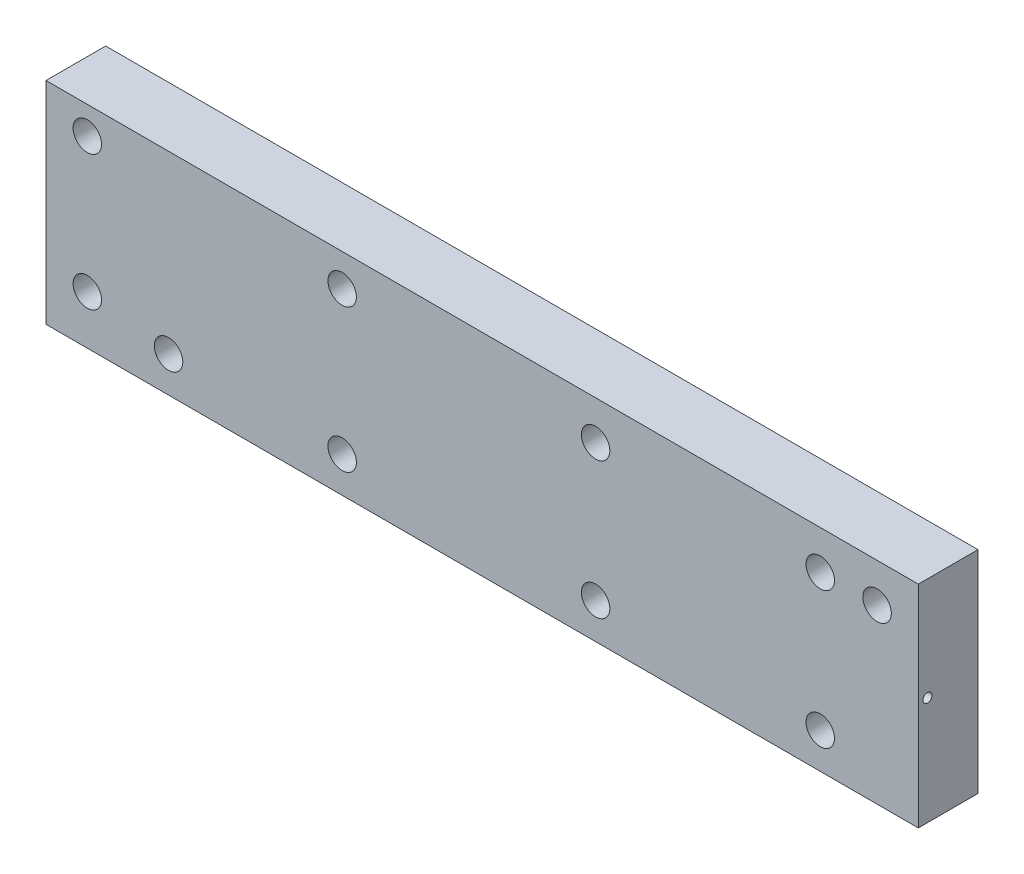
ISO-10303-21;
HEADER;
FILE_DESCRIPTION(('STEP AP214'),'2;1');
FILE_NAME('part.step','',(''),(''),'','','');
FILE_SCHEMA(('AUTOMOTIVE_DESIGN { 1 0 10303 214 1 1 1 1 }'));
ENDSEC;
DATA;
#1=APPLICATION_CONTEXT('core data for automotive mechanical design processes');
#2=APPLICATION_PROTOCOL_DEFINITION('international standard','automotive_design',2000,#1);
#3=PRODUCT_CONTEXT('',#1,'mechanical');
#4=PRODUCT('Part','Part','',(#3));
#5=PRODUCT_RELATED_PRODUCT_CATEGORY('part','',(#4));
#6=PRODUCT_DEFINITION_FORMATION('','',#4);
#7=PRODUCT_DEFINITION_CONTEXT('part definition',#1,'design');
#8=PRODUCT_DEFINITION('design','',#6,#7);
#9=PRODUCT_DEFINITION_SHAPE('','',#8);
#10=(LENGTH_UNIT() NAMED_UNIT(*) SI_UNIT(.MILLI.,.METRE.));
#11=(NAMED_UNIT(*) PLANE_ANGLE_UNIT() SI_UNIT($,.RADIAN.));
#12=(NAMED_UNIT(*) SI_UNIT($,.STERADIAN.) SOLID_ANGLE_UNIT());
#13=UNCERTAINTY_MEASURE_WITH_UNIT(LENGTH_MEASURE(1.E-05),#10,'distance_accuracy_value','');
#14=(GEOMETRIC_REPRESENTATION_CONTEXT(3) GLOBAL_UNCERTAINTY_ASSIGNED_CONTEXT((#13)) GLOBAL_UNIT_ASSIGNED_CONTEXT((#10,
#11,#12)) REPRESENTATION_CONTEXT('',''));
#15=CARTESIAN_POINT('',(0.,0.,0.));
#16=DIRECTION('',(0.,0.,1.));
#17=DIRECTION('',(1.,0.,0.));
#18=AXIS2_PLACEMENT_3D('',#15,#16,#17);
#19=CARTESIAN_POINT('',(12.49,31.,15.));
#20=DIRECTION('',(0.,0.,1.));
#21=DIRECTION('',(0.,-1.,0.));
#22=AXIS2_PLACEMENT_3D('',#19,#20,#21);
#23=PLANE('',#22);
#24=CARTESIAN_POINT('',(72.3541968671441,26.7675678602719,15.));
#25=DIRECTION('',(0.,0.,1.));
#26=DIRECTION('',(0.,-1.,0.));
#27=AXIS2_PLACEMENT_3D('',#24,#25,#26);
#28=CIRCLE('',#27,1.55);
#29=CARTESIAN_POINT('',(72.3541968671441,25.2175678602719,15.));
#30=VERTEX_POINT('',#29);
#31=EDGE_CURVE('E441',#30,#30,#28,.F.);
#32=ORIENTED_EDGE('',*,*,#31,.F.);
#33=EDGE_LOOP('',(#32));
#34=FACE_BOUND('',#33,.T.);
#35=CARTESIAN_POINT('',(103.008357344342,26.7675678602719,15.));
#36=DIRECTION('',(0.,0.,1.));
#37=DIRECTION('',(0.,-1.,0.));
#38=AXIS2_PLACEMENT_3D('',#35,#36,#37);
#39=CIRCLE('',#38,1.55);
#40=CARTESIAN_POINT('',(103.008357344342,25.2175678602719,15.));
#41=VERTEX_POINT('',#40);
#42=EDGE_CURVE('E436',#41,#41,#39,.F.);
#43=ORIENTED_EDGE('',*,*,#42,.F.);
#44=EDGE_LOOP('',(#43));
#45=FACE_BOUND('',#44,.T.);
#46=CARTESIAN_POINT('',(25.8461530651009,11.8834878470165,15.));
#47=DIRECTION('',(0.,0.,1.));
#48=DIRECTION('',(0.,-1.,0.));
#49=AXIS2_PLACEMENT_3D('',#46,#47,#48);
#50=CIRCLE('',#49,1.54999999999999);
#51=CARTESIAN_POINT('',(25.8461530651009,10.3334878470165,15.));
#52=VERTEX_POINT('',#51);
#53=EDGE_CURVE('E430',#52,#52,#50,.F.);
#54=ORIENTED_EDGE('',*,*,#53,.F.);
#55=EDGE_LOOP('',(#54));
#56=FACE_BOUND('',#55,.T.);
#57=CARTESIAN_POINT('',(72.3541968671441,11.8834878470165,15.));
#58=DIRECTION('',(0.,0.,1.));
#59=DIRECTION('',(0.,-1.,0.));
#60=AXIS2_PLACEMENT_3D('',#57,#58,#59);
#61=CIRCLE('',#60,1.55);
#62=CARTESIAN_POINT('',(72.3541968671441,10.3334878470165,15.));
#63=VERTEX_POINT('',#62);
#64=EDGE_CURVE('E424',#63,#63,#61,.F.);
#65=ORIENTED_EDGE('',*,*,#64,.F.);
#66=EDGE_LOOP('',(#65));
#67=FACE_BOUND('',#66,.T.);
#68=CARTESIAN_POINT('',(17.,28.,15.));
#69=DIRECTION('',(0.,0.,1.));
#70=DIRECTION('',(0.,-1.,0.));
#71=AXIS2_PLACEMENT_3D('',#68,#69,#70);
#72=CIRCLE('',#71,1.54999999999999);
#73=CARTESIAN_POINT('',(17.,26.45,15.));
#74=VERTEX_POINT('',#73);
#75=EDGE_CURVE('E419',#74,#74,#72,.F.);
#76=ORIENTED_EDGE('',*,*,#75,.F.);
#77=EDGE_LOOP('',(#76));
#78=FACE_BOUND('',#77,.T.);
#79=DIRECTION('',(0.,1.,0.));
#80=VECTOR('',#79,1.);
#81=CARTESIAN_POINT('',(14.5,19.4953488288822,15.));
#82=LINE('',#81,#80);
#83=CARTESIAN_POINT('',(14.4999999999998,23.5953488288822,15.));
#84=VERTEX_POINT('',#83);
#85=CARTESIAN_POINT('',(14.5,19.4953488288822,15.));
#86=VERTEX_POINT('',#85);
#87=EDGE_CURVE('E411',#84,#86,#82,.F.);
#88=ORIENTED_EDGE('',*,*,#87,.T.);
#89=DIRECTION('',(0.00465114596278413,0.999989183362117,0.));
#90=VECTOR('',#89,1.);
#91=CARTESIAN_POINT('',(14.5,19.4953488288822,15.));
#92=LINE('',#91,#90);
#93=CARTESIAN_POINT('',(14.4809303015523,15.3953931770975,15.));
#94=VERTEX_POINT('',#93);
#95=EDGE_CURVE('E59',#86,#94,#92,.F.);
#96=ORIENTED_EDGE('',*,*,#95,.T.);
#97=DIRECTION('',(0.999989183362117,-0.00465114596278426,0.));
#98=VECTOR('',#97,1.);
#99=CARTESIAN_POINT('',(-1748.49684365872,23.5953488288822,15.));
#100=LINE('',#99,#98);
#101=CARTESIAN_POINT('',(19.9808708100442,15.3698118743025,15.));
#102=VERTEX_POINT('',#101);
#103=EDGE_CURVE('E410',#94,#102,#100,.T.);
#104=ORIENTED_EDGE('',*,*,#103,.T.);
#105=DIRECTION('',(0.00465114596278346,0.999989183362117,0.));
#106=VECTOR('',#105,1.);
#107=CARTESIAN_POINT('',(20.,19.4825581083082,15.));
#108=LINE('',#107,#106);
#109=CARTESIAN_POINT('',(19.9738940911001,13.8698280992594,15.));
#110=VERTEX_POINT('',#109);
#111=EDGE_CURVE('E455',#102,#110,#108,.F.);
#112=ORIENTED_EDGE('',*,*,#111,.T.);
#113=DIRECTION('',(0.999859873952876,0.0167401451289695,0.));
#114=VECTOR('',#113,1.);
#115=CARTESIAN_POINT('',(314.329260657533,18.7980702301612,15.));
#116=LINE('',#115,#114);
#117=CARTESIAN_POINT('',(99.9809897930609,15.2093461940302,15.));
#118=VERTEX_POINT('',#117);
#119=EDGE_CURVE('E389',#110,#118,#116,.T.);
#120=ORIENTED_EDGE('',*,*,#119,.T.);
#121=DIRECTION('',(0.00465114596278346,0.999989183362117,0.));
#122=VECTOR('',#121,1.);
#123=CARTESIAN_POINT('',(100.,19.2965112635962,15.));
#124=LINE('',#123,#122);
#125=CARTESIAN_POINT('',(99.9879665120051,16.7093299690761,15.));
#126=VERTEX_POINT('',#125);
#127=EDGE_CURVE('E384',#118,#126,#124,.T.);
#128=ORIENTED_EDGE('',*,*,#127,.T.);
#129=DIRECTION('',(0.999989183362117,-0.00465114596278426,0.));
#130=VECTOR('',#129,1.);
#131=CARTESIAN_POINT('',(-1012.49799841773,21.8837205430222,15.));
#132=LINE('',#131,#130);
#133=CARTESIAN_POINT('',(105.487907020497,16.6837486662808,15.));
#134=VERTEX_POINT('',#133);
#135=EDGE_CURVE('E377',#126,#134,#132,.T.);
#136=ORIENTED_EDGE('',*,*,#135,.T.);
#137=DIRECTION('',(0.00465114596278591,0.999989183362117,0.));
#138=VECTOR('',#137,1.);
#139=CARTESIAN_POINT('',(105.5,19.2837205430222,15.));
#140=LINE('',#139,#138);
#141=CARTESIAN_POINT('',(105.5,19.2837205430222,15.));
#142=VERTEX_POINT('',#141);
#143=EDGE_CURVE('E11',#134,#142,#140,.T.);
#144=ORIENTED_EDGE('',*,*,#143,.T.);
#145=DIRECTION('',(0.,1.,0.));
#146=VECTOR('',#145,1.);
#147=CARTESIAN_POINT('',(105.5,19.2837205430222,15.));
#148=LINE('',#147,#146);
#149=CARTESIAN_POINT('',(105.5,21.8837205430222,15.));
#150=VERTEX_POINT('',#149);
#151=EDGE_CURVE('E45',#142,#150,#148,.T.);
#152=ORIENTED_EDGE('',*,*,#151,.T.);
#153=DIRECTION('',(-1.,0.,0.));
#154=VECTOR('',#153,1.);
#155=CARTESIAN_POINT('',(-1012.49799841773,21.8837205430222,15.));
#156=LINE('',#155,#154);
#157=CARTESIAN_POINT('',(100.,21.8837205430222,15.));
#158=VERTEX_POINT('',#157);
#159=EDGE_CURVE('E383',#150,#158,#156,.T.);
#160=ORIENTED_EDGE('',*,*,#159,.T.);
#161=DIRECTION('',(0.,1.,0.));
#162=VECTOR('',#161,1.);
#163=CARTESIAN_POINT('',(100.,19.2965112635962,15.));
#164=LINE('',#163,#162);
#165=CARTESIAN_POINT('',(100.,23.383720543025,15.));
#166=VERTEX_POINT('',#165);
#167=EDGE_CURVE('E392',#158,#166,#164,.T.);
#168=ORIENTED_EDGE('',*,*,#167,.T.);
#169=DIRECTION('',(-0.999771197972252,0.0213904582729674,0.));
#170=VECTOR('',#169,1.);
#171=CARTESIAN_POINT('',(314.329260657533,18.7980702301612,15.));
#172=LINE('',#171,#170);
#173=CARTESIAN_POINT('',(20.,25.0953488288818,15.));
#174=VERTEX_POINT('',#173);
#175=EDGE_CURVE('E414',#166,#174,#172,.T.);
#176=ORIENTED_EDGE('',*,*,#175,.T.);
#177=DIRECTION('',(0.,1.,0.));
#178=VECTOR('',#177,1.);
#179=CARTESIAN_POINT('',(20.,19.4825581083082,15.));
#180=LINE('',#179,#178);
#181=CARTESIAN_POINT('',(20.,23.5953488288819,15.));
#182=VERTEX_POINT('',#181);
#183=EDGE_CURVE('E460',#174,#182,#180,.F.);
#184=ORIENTED_EDGE('',*,*,#183,.T.);
#185=DIRECTION('',(-1.,0.,0.));
#186=VECTOR('',#185,1.);
#187=CARTESIAN_POINT('',(-1748.49684365872,23.5953488288822,15.));
#188=LINE('',#187,#186);
#189=EDGE_CURVE('E407',#182,#84,#188,.T.);
#190=ORIENTED_EDGE('',*,*,#189,.T.);
#191=EDGE_LOOP('',(#88,#96,#104,#112,#120,#128,#136,#144,#152,#160,#168,#176,#184,#190));
#192=FACE_BOUND('',#191,.T.);
#193=DIRECTION('',(1.,0.,0.));
#194=VECTOR('',#193,1.);
#195=CARTESIAN_POINT('',(135.,31.,15.));
#196=LINE('',#195,#194);
#197=CARTESIAN_POINT('',(12.5,31.,15.));
#198=VERTEX_POINT('',#197);
#199=CARTESIAN_POINT('',(107.5,31.,15.));
#200=VERTEX_POINT('',#199);
#201=EDGE_CURVE('E446',#198,#200,#196,.T.);
#202=ORIENTED_EDGE('',*,*,#201,.T.);
#203=DIRECTION('',(0.,1.,0.));
#204=VECTOR('',#203,1.);
#205=CARTESIAN_POINT('',(107.5,-104.,15.));
#206=LINE('',#205,#204);
#207=CARTESIAN_POINT('',(107.5,8.,15.));
#208=VERTEX_POINT('',#207);
#209=EDGE_CURVE('E147',#208,#200,#206,.T.);
#210=ORIENTED_EDGE('',*,*,#209,.F.);
#211=DIRECTION('',(1.,0.,0.));
#212=VECTOR('',#211,1.);
#213=CARTESIAN_POINT('',(135.,8.,15.));
#214=LINE('',#213,#212);
#215=CARTESIAN_POINT('',(12.5,8.,15.));
#216=VERTEX_POINT('',#215);
#217=EDGE_CURVE('E444',#216,#208,#214,.T.);
#218=ORIENTED_EDGE('',*,*,#217,.F.);
#219=DIRECTION('',(0.,-1.,0.));
#220=VECTOR('',#219,1.);
#221=CARTESIAN_POINT('',(12.5,-104.,15.));
#222=LINE('',#221,#220);
#223=EDGE_CURVE('E230',#198,#216,#222,.T.);
#224=ORIENTED_EDGE('',*,*,#223,.F.);
#225=EDGE_LOOP('',(#202,#210,#218,#224));
#226=FACE_BOUND('',#225,.T.);
#227=CARTESIAN_POINT('',(96.8197135493571,11.8834878470165,15.));
#228=DIRECTION('',(0.,0.,1.));
#229=DIRECTION('',(0.,-1.,0.));
#230=AXIS2_PLACEMENT_3D('',#227,#228,#229);
#231=CIRCLE('',#230,1.55);
#232=CARTESIAN_POINT('',(96.8197135493571,10.3334878470165,15.));
#233=VERTEX_POINT('',#232);
#234=EDGE_CURVE('E422',#233,#233,#231,.F.);
#235=ORIENTED_EDGE('',*,*,#234,.F.);
#236=EDGE_LOOP('',(#235));
#237=FACE_BOUND('',#236,.T.);
#238=CARTESIAN_POINT('',(44.7527820765865,11.8834878470165,15.));
#239=DIRECTION('',(0.,0.,1.));
#240=DIRECTION('',(0.,-1.,0.));
#241=AXIS2_PLACEMENT_3D('',#238,#239,#240);
#242=CIRCLE('',#241,1.55);
#243=CARTESIAN_POINT('',(44.7527820765865,10.3334878470165,15.));
#244=VERTEX_POINT('',#243);
#245=EDGE_CURVE('E427',#244,#244,#242,.F.);
#246=ORIENTED_EDGE('',*,*,#245,.F.);
#247=EDGE_LOOP('',(#246));
#248=FACE_BOUND('',#247,.T.);
#249=CARTESIAN_POINT('',(17.,13.3193439369581,15.));
#250=DIRECTION('',(0.,0.,1.));
#251=DIRECTION('',(0.,-1.,0.));
#252=AXIS2_PLACEMENT_3D('',#249,#250,#251);
#253=CIRCLE('',#252,1.54999999999999);
#254=CARTESIAN_POINT('',(17.,11.7693439369581,15.));
#255=VERTEX_POINT('',#254);
#256=EDGE_CURVE('E433',#255,#255,#253,.F.);
#257=ORIENTED_EDGE('',*,*,#256,.F.);
#258=EDGE_LOOP('',(#257));
#259=FACE_BOUND('',#258,.T.);
#260=CARTESIAN_POINT('',(96.8197135493571,26.7675678602719,15.));
#261=DIRECTION('',(0.,0.,1.));
#262=DIRECTION('',(0.,-1.,0.));
#263=AXIS2_PLACEMENT_3D('',#260,#261,#262);
#264=CIRCLE('',#263,1.55);
#265=CARTESIAN_POINT('',(96.8197135493571,25.2175678602719,15.));
#266=VERTEX_POINT('',#265);
#267=EDGE_CURVE('E439',#266,#266,#264,.F.);
#268=ORIENTED_EDGE('',*,*,#267,.F.);
#269=EDGE_LOOP('',(#268));
#270=FACE_BOUND('',#269,.T.);
#271=CARTESIAN_POINT('',(44.7527820765865,27.4726032293202,15.));
#272=DIRECTION('',(0.,0.,1.));
#273=DIRECTION('',(0.,-1.,0.));
#274=AXIS2_PLACEMENT_3D('',#271,#272,#273);
#275=CIRCLE('',#274,1.55);
#276=CARTESIAN_POINT('',(44.7527820765865,25.9226032293202,15.));
#277=VERTEX_POINT('',#276);
#278=EDGE_CURVE('E40',#277,#277,#275,.F.);
#279=ORIENTED_EDGE('',*,*,#278,.F.);
#280=EDGE_LOOP('',(#279));
#281=FACE_BOUND('',#280,.T.);
#282=ADVANCED_FACE('F37',(#34,#45,#56,#67,#78,#192,#226,#237,#248,#259,#270,#281),#23,.F.);
#283=CARTESIAN_POINT('',(99.,20.,16.));
#284=DIRECTION('',(0.,0.,1.));
#285=DIRECTION('',(1.,0.,0.));
#286=AXIS2_PLACEMENT_3D('',#283,#284,#285);
#287=CYLINDRICAL_SURFACE('',#286,0.499999999999999);
#288=DIRECTION('',(0.,0.,1.));
#289=VECTOR('',#288,1.);
#290=CARTESIAN_POINT('',(98.95,19.5025062814467,16.));
#291=LINE('',#290,#289);
#292=CARTESIAN_POINT('',(98.95,19.5025062814467,20.919118057874));
#293=VERTEX_POINT('',#292);
#294=CARTESIAN_POINT('',(98.95,19.5025062814467,20.0860205677891));
#295=VERTEX_POINT('',#294);
#296=EDGE_CURVE('E228',#293,#295,#291,.F.);
#297=ORIENTED_EDGE('',*,*,#296,.T.);
#298=CARTESIAN_POINT('',(99.4701014681041,19.8296926023733,21.));
#299=CARTESIAN_POINT('',(99.4774688546878,19.8499127723279,20.9979842904962));
#300=CARTESIAN_POINT('',(99.4834085464336,19.8704958048309,20.9946040285803));
#301=CARTESIAN_POINT('',(99.4925442452967,19.9115218747577,20.9851516344699));
#302=CARTESIAN_POINT('',(99.495756197269,19.9319650230435,20.979095465069));
#303=CARTESIAN_POINT('',(99.4996314927335,19.9721009031409,20.9643045231302));
#304=CARTESIAN_POINT('',(99.5002948625877,19.9917936427125,20.9555697782999));
#305=CARTESIAN_POINT('',(99.4994706969462,20.0298587441883,20.9356586299746));
#306=CARTESIAN_POINT('',(99.4979811139956,20.0482298317554,20.9244799108475));
#307=CARTESIAN_POINT('',(99.4932647506171,20.0838004227334,20.8995903586521));
#308=CARTESIAN_POINT('',(99.4899837937804,20.1009434640651,20.8858098217039));
#309=CARTESIAN_POINT('',(99.4822336342976,20.1331361659019,20.8562846501941));
#310=CARTESIAN_POINT('',(99.4777637694054,20.148184652559,20.8405389235843));
#311=CARTESIAN_POINT('',(99.4672837241488,20.1787609896256,20.8040947204159));
#312=CARTESIAN_POINT('',(99.4611432182762,20.1938082661447,20.7830295939592));
#313=CARTESIAN_POINT('',(99.4489884944372,20.2205107731916,20.7387862072529));
#314=CARTESIAN_POINT('',(99.4429744382683,20.2321618773428,20.7156054209708));
#315=CARTESIAN_POINT('',(99.4314867831335,20.2529353790743,20.6647084715541));
#316=CARTESIAN_POINT('',(99.4261530042551,20.2616179526596,20.6367765523052));
#317=CARTESIAN_POINT('',(99.4183182044755,20.2739829819091,20.5794726795957));
#318=CARTESIAN_POINT('',(99.4158101298066,20.2776778928029,20.5501045037275));
#319=CARTESIAN_POINT('',(99.4144741278076,20.2796626470272,20.4951847310749));
#320=CARTESIAN_POINT('',(99.4151850689781,20.2786295427458,20.4696672234916));
#321=CARTESIAN_POINT('',(99.4190797874766,20.2727343555928,20.419265578987));
#322=CARTESIAN_POINT('',(99.4222654437116,20.2678693633527,20.3943819381562));
#323=CARTESIAN_POINT('',(99.4301885645206,20.2549331699153,20.3472693659653));
#324=CARTESIAN_POINT('',(99.4348301847968,20.2470547145151,20.3249697408449));
#325=CARTESIAN_POINT('',(99.4449475443564,20.2283305472458,20.2818488804111));
#326=CARTESIAN_POINT('',(99.4504239036889,20.2174826248315,20.2610287610805));
#327=CARTESIAN_POINT('',(99.4624244368935,20.1908230760405,20.2175802674018));
#328=CARTESIAN_POINT('',(99.4689624890417,20.1744727084044,20.1952842055542));
#329=CARTESIAN_POINT('',(99.4809181656528,20.1381400597493,20.1535245114158));
#330=CARTESIAN_POINT('',(99.4863366101286,20.1181604571199,20.1340588092574));
#331=CARTESIAN_POINT('',(99.4940278146444,20.0790790660161,20.1019380807881));
#332=CARTESIAN_POINT('',(99.4967045460814,20.0605436449207,20.0886928309633));
#333=CARTESIAN_POINT('',(99.49990775248,20.0216994598741,20.0647917445634));
#334=CARTESIAN_POINT('',(99.5004362504364,20.001392382715,20.0541334807194));
#335=CARTESIAN_POINT('',(99.4987966969851,19.9594473548212,20.0356735523955));
#336=CARTESIAN_POINT('',(99.4966113200138,19.937801700056,20.027890657647));
#337=CARTESIAN_POINT('',(99.4891659120319,19.8941410152587,20.0154624482384));
#338=CARTESIAN_POINT('',(99.4839070133731,19.872126124161,20.010815979409));
#339=CARTESIAN_POINT('',(99.470986951121,19.830917816833,20.0048746038622));
#340=CARTESIAN_POINT('',(99.4636326262835,19.8116691421163,20.0032813070208));
#341=CARTESIAN_POINT('',(99.4465781960761,19.7741856430768,20.002241481801));
#342=CARTESIAN_POINT('',(99.4368775611793,19.755951048761,20.0027954384501));
#343=CARTESIAN_POINT('',(99.4148955209144,19.7201372189167,20.0057146824016));
#344=CARTESIAN_POINT('',(99.402517663202,19.7026243477743,20.0081603180715));
#345=CARTESIAN_POINT('',(99.3757751596434,19.6694741611717,20.0144361803188));
#346=CARTESIAN_POINT('',(99.3614097139939,19.6538376054926,20.018266965285));
#347=CARTESIAN_POINT('',(99.3282394656705,19.6220089808324,20.0275393655168));
#348=CARTESIAN_POINT('',(99.3090997224873,19.6062142755736,20.033146374118));
#349=CARTESIAN_POINT('',(99.2687439855616,19.5776382793501,20.0446790088129));
#350=CARTESIAN_POINT('',(99.2475248511638,19.564861649232,20.0506051105801));
#351=CARTESIAN_POINT('',(99.1997933230874,19.5407548740718,20.0627781922216));
#352=CARTESIAN_POINT('',(99.1729746016716,19.5299733635102,20.0689276106349));
#353=CARTESIAN_POINT('',(99.1175330796776,19.5131539614114,20.0790277069308));
#354=CARTESIAN_POINT('',(99.0889160072931,19.5071017585535,20.0829850076991));
#355=CARTESIAN_POINT('',(99.0417249554963,19.501408157889,20.0867432752652));
#356=CARTESIAN_POINT('',(99.0234073889952,19.5002140785748,20.0875461945066));
#357=CARTESIAN_POINT('',(98.9866811187587,19.4998368022868,20.0878105878154));
#358=CARTESIAN_POINT('',(98.9682723157987,19.500660387847,20.0872675372311));
#359=CARTESIAN_POINT('',(98.95,19.5025062814467,20.0860205677891));
#360=B_SPLINE_CURVE_WITH_KNOTS('',3,(#298,#299,#300,#301,#302,#303,#304,#305,#306,#307,#308,
#309,#310,#311,#312,#313,#314,#315,#316,#317,#318,#319,#320,#321,#322,#323,#324,#325,#326,#327,
#328,#329,#330,#331,#332,#333,#334,#335,#336,#337,#338,#339,#340,#341,#342,#343,#344,#345,#346,
#347,#348,#349,#350,#351,#352,#353,#354,#355,#356,#357,#358,#359),.UNSPECIFIED.,.F.,.F.,(4,2,2,
2,2,2,2,2,2,2,2,2,2,2,2,2,2,2,2,2,2,2,2,2,2,2,2,2,2,2,4),(0.,0.0647290245250579,0.1290770223543,
0.193424354580422,0.257832921303913,0.324306933423682,0.390818050749882,0.470321411939918,
0.549920971505537,0.638596933170055,0.727051040321775,0.803267833475031,0.879542550226478,
0.951587770671656,1.02368676991559,1.10854858975764,1.1933480338333,1.26188622253321,
1.33035985374064,1.39927288135139,1.46816053590199,1.52988145180107,1.591616310206,
1.65612784413127,1.72066541334236,1.79670117965547,1.87285361218891,1.9610538694392,
2.04898617970982,2.10395699193108,2.15911284612362),.UNSPECIFIED.);
#361=CARTESIAN_POINT('',(99.4701014681041,19.8296926023733,21.));
#362=VERTEX_POINT('',#361);
#363=EDGE_CURVE('E222',#362,#295,#360,.T.);
#364=ORIENTED_EDGE('',*,*,#363,.F.);
#365=CARTESIAN_POINT('',(99.,20.,21.));
#366=DIRECTION('',(0.,0.,1.));
#367=DIRECTION('',(1.,0.,0.));
#368=AXIS2_PLACEMENT_3D('',#365,#366,#367);
#369=CIRCLE('',#368,0.499999999999999);
#370=CARTESIAN_POINT('',(99.4198315160856,19.7284461414356,21.));
#371=VERTEX_POINT('',#370);
#372=EDGE_CURVE('E203',#362,#371,#369,.T.);
#373=ORIENTED_EDGE('',*,*,#372,.T.);
#374=CARTESIAN_POINT('',(98.95,19.5025062814467,20.919118057874));
#375=CARTESIAN_POINT('',(98.9624965972271,19.5012492106486,20.9182795934042));
#376=CARTESIAN_POINT('',(98.9750563476169,19.5004640640067,20.9177543183625));
#377=CARTESIAN_POINT('',(99.0002026466028,19.4998420414642,20.9173377679787));
#378=CARTESIAN_POINT('',(99.0127891761434,19.5000046322368,20.9174461360623));
#379=CARTESIAN_POINT('',(99.0502240641956,19.5019072607446,20.9187241382645));
#380=CARTESIAN_POINT('',(99.0749869604941,19.5050384579037,20.9208306896537));
#381=CARTESIAN_POINT('',(99.1234443958593,19.5148467577854,20.9270909126284));
#382=CARTESIAN_POINT('',(99.1471408686169,19.5215171367892,20.9312407014093));
#383=CARTESIAN_POINT('',(99.1931392384423,19.5381587409854,20.9408089746067));
#384=CARTESIAN_POINT('',(99.215436744906,19.5481397951203,20.9462312225886));
#385=CARTESIAN_POINT('',(99.2603261184848,19.5722834390689,20.9580217679895));
#386=CARTESIAN_POINT('',(99.2827403038141,19.5867557243691,20.9644309040114));
#387=CARTESIAN_POINT('',(99.325052222324,19.6191484020611,20.9766194595065));
#388=CARTESIAN_POINT('',(99.34495604051,19.6370601803873,20.9824003967983));
#389=CARTESIAN_POINT('',(99.3737920024126,19.667571024913,20.9901112422122));
#390=CARTESIAN_POINT('',(99.3837273004194,19.6790865492227,20.9926218508166));
#391=CARTESIAN_POINT('',(99.4025746948953,19.7030710978297,20.9969103213568));
#392=CARTESIAN_POINT('',(99.4114857036664,19.7155411127269,20.9986874094563));
#393=CARTESIAN_POINT('',(99.4198315160856,19.7284461414356,21.));
#394=B_SPLINE_CURVE_WITH_KNOTS('',3,(#374,#375,#376,#377,#378,#379,#380,#381,#382,#383,#384,
#385,#386,#387,#388,#389,#390,#391,#392,#393),.UNSPECIFIED.,.F.,.F.,(4,2,2,2,2,2,2,2,2,4),(0.,
0.037739301385199,0.075457367527859,0.150181501446608,0.224764180497007,0.299570297377233,
0.381566175862673,0.463359316092883,0.50953094221899,0.555751153924889),.UNSPECIFIED.);
#395=EDGE_CURVE('E227',#293,#371,#394,.T.);
#396=ORIENTED_EDGE('',*,*,#395,.F.);
#397=EDGE_LOOP('',(#297,#364,#373,#396));
#398=FACE_BOUND('',#397,.T.);
#399=CARTESIAN_POINT('',(98.6442776283622,19.6486288830235,19.0980535592392));
#400=CARTESIAN_POINT('',(98.6639118073722,19.6287532179292,19.099365509122));
#401=CARTESIAN_POINT('',(98.685238733778,19.6105041582648,19.1003615489505));
#402=CARTESIAN_POINT('',(98.7306702362938,19.5778076803801,19.1018334368221));
#403=CARTESIAN_POINT('',(98.7547777396331,19.5633643220794,19.1023087310269));
#404=CARTESIAN_POINT('',(98.8050603197376,19.5387172703958,19.1028520209217));
#405=CARTESIAN_POINT('',(98.8312342615941,19.5285112688281,19.1029202386271));
#406=CARTESIAN_POINT('',(98.8849126832868,19.5126209388884,19.1027453384334));
#407=CARTESIAN_POINT('',(98.9124168893627,19.5069356843381,19.1025022843322));
#408=CARTESIAN_POINT('',(98.9680452901828,19.5002346661814,19.1017677457357));
#409=CARTESIAN_POINT('',(98.9961706901737,19.4992289627337,19.1012757285298));
#410=CARTESIAN_POINT('',(99.0521888253917,19.5019410430946,19.1000664566654));
#411=CARTESIAN_POINT('',(99.0800815513319,19.5056590145441,19.0993491930601));
#412=CARTESIAN_POINT('',(99.1348861022054,19.5177198154422,19.0976694539896));
#413=CARTESIAN_POINT('',(99.1617963513786,19.5260697541267,19.0967066028218));
#414=CARTESIAN_POINT('',(99.2138256100011,19.5471572736037,19.0944800116797));
#415=CARTESIAN_POINT('',(99.2389446205736,19.5598948516453,19.093216271894));
#416=CARTESIAN_POINT('',(99.2866853170021,19.5893918189684,19.09030480816));
#417=CARTESIAN_POINT('',(99.3093061782029,19.6061525305525,19.0886569579695));
#418=CARTESIAN_POINT('',(99.3513990857811,19.6432020444003,19.084884398081));
#419=CARTESIAN_POINT('',(99.3708711813345,19.6634907915546,19.0827596958314));
#420=CARTESIAN_POINT('',(99.4061212813782,19.7069993094862,19.0779485681146));
#421=CARTESIAN_POINT('',(99.4218992150937,19.7302191364055,19.0752621318871));
#422=CARTESIAN_POINT('',(99.4493304848308,19.7789053091294,19.0692700700642));
#423=CARTESIAN_POINT('',(99.4609838169861,19.8043716570397,19.0659644438884));
#424=CARTESIAN_POINT('',(99.4798982066447,19.8568938953284,19.0587079373691));
#425=CARTESIAN_POINT('',(99.4871448217275,19.883954696892,19.0547549886618));
#426=CARTESIAN_POINT('',(99.4970243233767,19.938813551295,19.0462517889327));
#427=CARTESIAN_POINT('',(99.4996569432006,19.9666116466642,19.0417015033943));
#428=CARTESIAN_POINT('',(99.5002837741891,20.0224949678258,19.0320469072202));
#429=CARTESIAN_POINT('',(99.4982238427238,20.0505797851252,19.026936783817));
#430=CARTESIAN_POINT('',(99.4894500775863,20.1059456990636,19.0163677454663));
#431=CARTESIAN_POINT('',(99.4827357137809,20.1332267037803,19.0109087908518));
#432=CARTESIAN_POINT('',(99.464703002911,20.1867109502839,18.9997616285321));
#433=CARTESIAN_POINT('',(99.4533084021397,20.2128880195923,18.9940711018974));
#434=CARTESIAN_POINT('',(99.4262241375252,20.2629507258796,18.9828189886846));
#435=CARTESIAN_POINT('',(99.4105340972689,20.2868361617929,18.9772574134528));
#436=CARTESIAN_POINT('',(99.3751538085751,20.3317869411573,18.9665315772364));
#437=CARTESIAN_POINT('',(99.3554397970389,20.3528342376555,18.9613699401793));
#438=CARTESIAN_POINT('',(99.3125853936342,20.3913044219291,18.9518031550846));
#439=CARTESIAN_POINT('',(99.2894453672948,20.4087276958831,18.9473979264523));
#440=CARTESIAN_POINT('',(99.240885265801,20.439063424427,18.9397343162875));
#441=CARTESIAN_POINT('',(99.2155226955323,20.4520622460933,18.9364539658427));
#442=CARTESIAN_POINT('',(99.1628446214462,20.4735932912172,18.931165793708));
#443=CARTESIAN_POINT('',(99.1355296600271,20.4821267497681,18.9291576201091));
#444=CARTESIAN_POINT('',(99.080840932457,20.4941851496691,18.9266341237527));
#445=CARTESIAN_POINT('',(99.0535088004551,20.4978880040298,18.9260649996176));
#446=CARTESIAN_POINT('',(98.9986162897586,20.5007525594579,18.9263228837002));
#447=CARTESIAN_POINT('',(98.971055944331,20.4999149111548,18.9271496918768));
#448=CARTESIAN_POINT('',(98.9170837860674,20.4938091885474,18.9301251492837));
#449=CARTESIAN_POINT('',(98.8906600097688,20.4886324910256,18.9322462922626));
#450=CARTESIAN_POINT('',(98.8390939907852,20.4741588154427,18.937656787168));
#451=CARTESIAN_POINT('',(98.8139518406242,20.4648615403744,18.9409462233007));
#452=CARTESIAN_POINT('',(98.7651655498171,20.4422536958424,18.9485631241689));
#453=CARTESIAN_POINT('',(98.7415555738685,20.4288753542283,18.952907843799));
#454=CARTESIAN_POINT('',(98.6969024170357,20.3985728750711,18.9623514505185));
#455=CARTESIAN_POINT('',(98.6758597508033,20.3816480284253,18.9674504883694));
#456=CARTESIAN_POINT('',(98.636046646496,20.3439746927847,18.9783446009619));
#457=CARTESIAN_POINT('',(98.6174004588662,20.3231005296703,18.9841593363216));
#458=CARTESIAN_POINT('',(98.5838625724069,20.2785798297343,18.9960058742143));
#459=CARTESIAN_POINT('',(98.5689715444342,20.2549327986456,19.0020377153134));
#460=CARTESIAN_POINT('',(98.54295435188,20.204768197417,19.014202545222));
#461=CARTESIAN_POINT('',(98.5319478729173,20.1781879280341,19.0203335020105));
#462=CARTESIAN_POINT('',(98.514633622152,20.1234627879741,19.0322419059751));
#463=CARTESIAN_POINT('',(98.5083257296798,20.0953179574982,19.0380193622262));
#464=CARTESIAN_POINT('',(98.5006428886348,20.0383113989186,19.0489796465435));
#465=CARTESIAN_POINT('',(98.4992572273157,20.0094513655087,19.0541637421545));
#466=CARTESIAN_POINT('',(98.5014940438912,19.9517932740901,19.0637852284013));
#467=CARTESIAN_POINT('',(98.505116956392,19.9229952216768,19.0682225542006));
#468=CARTESIAN_POINT('',(98.5171909557283,19.866960611517,19.0761666260789));
#469=CARTESIAN_POINT('',(98.52553640299,19.8397037832456,19.0796913520835));
#470=CARTESIAN_POINT('',(98.5467735494023,19.78694493572,19.0859087071225));
#471=CARTESIAN_POINT('',(98.5596598991785,19.7614408936755,19.0886023082841));
#472=CARTESIAN_POINT('',(98.5845106227582,19.7212114142872,19.0924194654993));
#473=CARTESIAN_POINT('',(98.5953002308935,19.7057683264934,19.0937655040497));
#474=CARTESIAN_POINT('',(98.6185624392304,19.6761798159928,19.0961401146563));
#475=CARTESIAN_POINT('',(98.6310350129923,19.6620343729057,19.097168691699));
#476=CARTESIAN_POINT('',(98.6442776283622,19.6486288830235,19.0980535592392));
#477=B_SPLINE_CURVE_WITH_KNOTS('',3,(#399,#400,#401,#402,#403,#404,#405,#406,#407,#408,#409,
#410,#411,#412,#413,#414,#415,#416,#417,#418,#419,#420,#421,#422,#423,#424,#425,#426,#427,#428,
#429,#430,#431,#432,#433,#434,#435,#436,#437,#438,#439,#440,#441,#442,#443,#444,#445,#446,#447,
#448,#449,#450,#451,#452,#453,#454,#455,#456,#457,#458,#459,#460,#461,#462,#463,#464,#465,#466,
#467,#468,#469,#470,#471,#472,#473,#474,#475,#476),.UNSPECIFIED.,.T.,.F.,(4,2,2,2,2,2,2,2,2,2,2,
2,2,2,2,2,2,2,2,2,2,2,2,2,2,2,2,2,2,2,2,2,2,2,2,2,2,2,4),(0.,0.0838381024969042,
0.167765284593441,0.251646689467256,0.335510904889217,0.41955532962654,0.503603093004901,
0.587780212912477,0.671957280044492,0.756162052030789,0.840365508818736,0.924570578690834,
1.00877572749292,1.09325538052217,1.17773991729511,1.26320416627444,1.34867815111035,
1.4356037568699,1.5225369824367,1.60999926036542,1.69745221346334,1.78308429614242,
1.86869268095502,1.9510496814232,2.03339488089235,2.11404829618687,2.19470752584703,
2.27678675386831,2.3588824088315,2.44425551695864,2.52964386614832,2.61747118228329,
2.70529624274852,2.7929300432009,2.88057144832918,2.96632576498255,3.05197939531753,
3.10852635785895,3.16507243213804),.UNSPECIFIED.);
#478=CARTESIAN_POINT('',(98.6442776283622,19.6486288830235,19.0980535592392));
#479=VERTEX_POINT('',#478);
#480=EDGE_CURVE('E271',#479,#479,#477,.T.);
#481=ORIENTED_EDGE('',*,*,#480,.F.);
#482=EDGE_LOOP('',(#481));
#483=FACE_BOUND('',#482,.T.);
#484=ADVANCED_FACE('F261',(#398,#483),#287,.F.);
#485=CARTESIAN_POINT('',(135.,31.,0.));
#486=DIRECTION('',(0.,1.,0.));
#487=DIRECTION('',(0.,0.,1.));
#488=AXIS2_PLACEMENT_3D('',#485,#486,#487);
#489=PLANE('',#488);
#490=ORIENTED_EDGE('',*,*,#201,.F.);
#491=DIRECTION('',(0.,0.,-1.));
#492=VECTOR('',#491,1.);
#493=CARTESIAN_POINT('',(12.5,31.,21.5));
#494=LINE('',#493,#492);
#495=CARTESIAN_POINT('',(12.5,31.,21.5));
#496=VERTEX_POINT('',#495);
#497=EDGE_CURVE('E166',#496,#198,#494,.T.);
#498=ORIENTED_EDGE('',*,*,#497,.F.);
#499=DIRECTION('',(-1.,0.,0.));
#500=VECTOR('',#499,1.);
#501=CARTESIAN_POINT('',(135.,31.,21.5));
#502=LINE('',#501,#500);
#503=CARTESIAN_POINT('',(107.5,31.,21.5));
#504=VERTEX_POINT('',#503);
#505=EDGE_CURVE('E158',#504,#496,#502,.T.);
#506=ORIENTED_EDGE('',*,*,#505,.F.);
#507=DIRECTION('',(0.,0.,1.));
#508=VECTOR('',#507,1.);
#509=CARTESIAN_POINT('',(107.5,31.,21.5));
#510=LINE('',#509,#508);
#511=EDGE_CURVE('E140',#200,#504,#510,.T.);
#512=ORIENTED_EDGE('',*,*,#511,.F.);
#513=EDGE_LOOP('',(#490,#498,#506,#512));
#514=FACE_BOUND('',#513,.T.);
#515=ADVANCED_FACE('F164',(#514),#489,.T.);
#516=CARTESIAN_POINT('',(135.,7.99999999999999,0.));
#517=DIRECTION('',(0.,1.,0.));
#518=DIRECTION('',(0.,0.,1.));
#519=AXIS2_PLACEMENT_3D('',#516,#517,#518);
#520=PLANE('',#519);
#521=DIRECTION('',(0.,0.,-1.));
#522=VECTOR('',#521,1.);
#523=CARTESIAN_POINT('',(12.5,7.99999999999999,0.));
#524=LINE('',#523,#522);
#525=CARTESIAN_POINT('',(12.5,7.99999999999999,21.5));
#526=VERTEX_POINT('',#525);
#527=EDGE_CURVE('E172',#526,#216,#524,.T.);
#528=ORIENTED_EDGE('',*,*,#527,.T.);
#529=ORIENTED_EDGE('',*,*,#217,.T.);
#530=DIRECTION('',(0.,0.,1.));
#531=VECTOR('',#530,1.);
#532=CARTESIAN_POINT('',(107.5,7.99999999999999,0.));
#533=LINE('',#532,#531);
#534=CARTESIAN_POINT('',(107.5,7.99999999999999,21.5));
#535=VERTEX_POINT('',#534);
#536=EDGE_CURVE('E471',#208,#535,#533,.T.);
#537=ORIENTED_EDGE('',*,*,#536,.T.);
#538=DIRECTION('',(-1.,0.,0.));
#539=VECTOR('',#538,1.);
#540=CARTESIAN_POINT('',(135.,8.,21.5));
#541=LINE('',#540,#539);
#542=EDGE_CURVE('E160',#535,#526,#541,.T.);
#543=ORIENTED_EDGE('',*,*,#542,.T.);
#544=EDGE_LOOP('',(#528,#529,#537,#543));
#545=FACE_BOUND('',#544,.T.);
#546=ADVANCED_FACE('F308',(#545),#520,.F.);
#547=CARTESIAN_POINT('',(135.,0.,21.5));
#548=DIRECTION('',(0.,0.,-1.));
#549=DIRECTION('',(-1.,0.,0.));
#550=AXIS2_PLACEMENT_3D('',#547,#548,#549);
#551=PLANE('',#550);
#552=CARTESIAN_POINT('',(72.3541968671441,11.8834878470165,21.5));
#553=DIRECTION('',(0.,0.,-1.));
#554=DIRECTION('',(-1.,0.,0.));
#555=AXIS2_PLACEMENT_3D('',#552,#553,#554);
#556=CIRCLE('',#555,1.55);
#557=CARTESIAN_POINT('',(70.8041968671441,11.8834878470165,21.5));
#558=VERTEX_POINT('',#557);
#559=EDGE_CURVE('E197',#558,#558,#556,.F.);
#560=ORIENTED_EDGE('',*,*,#559,.F.);
#561=EDGE_LOOP('',(#560));
#562=FACE_BOUND('',#561,.T.);
#563=CARTESIAN_POINT('',(25.8461530651009,11.8834878470165,21.5));
#564=DIRECTION('',(0.,0.,-1.));
#565=DIRECTION('',(-1.,0.,0.));
#566=AXIS2_PLACEMENT_3D('',#563,#564,#565);
#567=CIRCLE('',#566,1.54999999999999);
#568=CARTESIAN_POINT('',(24.2961530651009,11.8834878470165,21.5));
#569=VERTEX_POINT('',#568);
#570=EDGE_CURVE('E191',#569,#569,#567,.F.);
#571=ORIENTED_EDGE('',*,*,#570,.F.);
#572=EDGE_LOOP('',(#571));
#573=FACE_BOUND('',#572,.T.);
#574=CARTESIAN_POINT('',(103.008357344342,26.7675678602719,21.5));
#575=DIRECTION('',(0.,0.,-1.));
#576=DIRECTION('',(-1.,0.,0.));
#577=AXIS2_PLACEMENT_3D('',#574,#575,#576);
#578=CIRCLE('',#577,1.55);
#579=CARTESIAN_POINT('',(101.458357344342,26.7675678602719,21.5));
#580=VERTEX_POINT('',#579);
#581=EDGE_CURVE('E185',#580,#580,#578,.F.);
#582=ORIENTED_EDGE('',*,*,#581,.F.);
#583=EDGE_LOOP('',(#582));
#584=FACE_BOUND('',#583,.T.);
#585=CARTESIAN_POINT('',(72.3541968671441,26.7675678602719,21.5));
#586=DIRECTION('',(0.,0.,-1.));
#587=DIRECTION('',(-1.,0.,0.));
#588=AXIS2_PLACEMENT_3D('',#585,#586,#587);
#589=CIRCLE('',#588,1.55);
#590=CARTESIAN_POINT('',(70.8041968671441,26.7675678602719,21.5));
#591=VERTEX_POINT('',#590);
#592=EDGE_CURVE('E179',#591,#591,#589,.F.);
#593=ORIENTED_EDGE('',*,*,#592,.F.);
#594=EDGE_LOOP('',(#593));
#595=FACE_BOUND('',#594,.T.);
#596=CARTESIAN_POINT('',(17.,28.,21.5));
#597=DIRECTION('',(0.,0.,-1.));
#598=DIRECTION('',(-1.,0.,0.));
#599=AXIS2_PLACEMENT_3D('',#596,#597,#598);
#600=CIRCLE('',#599,1.54999999999999);
#601=CARTESIAN_POINT('',(15.45,28.,21.5));
#602=VERTEX_POINT('',#601);
#603=EDGE_CURVE('E167',#602,#602,#600,.F.);
#604=ORIENTED_EDGE('',*,*,#603,.F.);
#605=EDGE_LOOP('',(#604));
#606=FACE_BOUND('',#605,.T.);
#607=CARTESIAN_POINT('',(44.7527820765865,27.4726032293202,21.5));
#608=DIRECTION('',(0.,0.,-1.));
#609=DIRECTION('',(-1.,0.,0.));
#610=AXIS2_PLACEMENT_3D('',#607,#608,#609);
#611=CIRCLE('',#610,1.55);
#612=CARTESIAN_POINT('',(43.2027820765865,27.4726032293202,21.5));
#613=VERTEX_POINT('',#612);
#614=EDGE_CURVE('E170',#613,#613,#611,.F.);
#615=ORIENTED_EDGE('',*,*,#614,.F.);
#616=EDGE_LOOP('',(#615));
#617=FACE_BOUND('',#616,.T.);
#618=CARTESIAN_POINT('',(96.8197135493571,26.7675678602719,21.5));
#619=DIRECTION('',(0.,0.,-1.));
#620=DIRECTION('',(-1.,0.,0.));
#621=AXIS2_PLACEMENT_3D('',#618,#619,#620);
#622=CIRCLE('',#621,1.55);
#623=CARTESIAN_POINT('',(95.2697135493571,26.7675678602719,21.5));
#624=VERTEX_POINT('',#623);
#625=EDGE_CURVE('E182',#624,#624,#622,.F.);
#626=ORIENTED_EDGE('',*,*,#625,.F.);
#627=EDGE_LOOP('',(#626));
#628=FACE_BOUND('',#627,.T.);
#629=CARTESIAN_POINT('',(17.,13.3193439369581,21.5));
#630=DIRECTION('',(0.,0.,-1.));
#631=DIRECTION('',(-1.,0.,0.));
#632=AXIS2_PLACEMENT_3D('',#629,#630,#631);
#633=CIRCLE('',#632,1.54999999999999);
#634=CARTESIAN_POINT('',(15.45,13.3193439369581,21.5));
#635=VERTEX_POINT('',#634);
#636=EDGE_CURVE('E188',#635,#635,#633,.F.);
#637=ORIENTED_EDGE('',*,*,#636,.F.);
#638=EDGE_LOOP('',(#637));
#639=FACE_BOUND('',#638,.T.);
#640=CARTESIAN_POINT('',(44.7527820765865,11.8834878470165,21.5));
#641=DIRECTION('',(0.,0.,-1.));
#642=DIRECTION('',(-1.,0.,0.));
#643=AXIS2_PLACEMENT_3D('',#640,#641,#642);
#644=CIRCLE('',#643,1.55);
#645=CARTESIAN_POINT('',(43.2027820765865,11.8834878470165,21.5));
#646=VERTEX_POINT('',#645);
#647=EDGE_CURVE('E194',#646,#646,#644,.F.);
#648=ORIENTED_EDGE('',*,*,#647,.F.);
#649=EDGE_LOOP('',(#648));
#650=FACE_BOUND('',#649,.T.);
#651=CARTESIAN_POINT('',(96.8197135493571,11.8834878470165,21.5));
#652=DIRECTION('',(0.,0.,-1.));
#653=DIRECTION('',(-1.,0.,0.));
#654=AXIS2_PLACEMENT_3D('',#651,#652,#653);
#655=CIRCLE('',#654,1.55);
#656=CARTESIAN_POINT('',(95.2697135493571,11.8834878470165,21.5));
#657=VERTEX_POINT('',#656);
#658=EDGE_CURVE('E200',#657,#657,#655,.F.);
#659=ORIENTED_EDGE('',*,*,#658,.F.);
#660=EDGE_LOOP('',(#659));
#661=FACE_BOUND('',#660,.T.);
#662=ORIENTED_EDGE('',*,*,#542,.F.);
#663=DIRECTION('',(0.,1.,0.));
#664=VECTOR('',#663,1.);
#665=CARTESIAN_POINT('',(107.5,-104.,21.5));
#666=LINE('',#665,#664);
#667=EDGE_CURVE('E144',#535,#504,#666,.T.);
#668=ORIENTED_EDGE('',*,*,#667,.T.);
#669=ORIENTED_EDGE('',*,*,#505,.T.);
#670=DIRECTION('',(0.,1.,0.));
#671=VECTOR('',#670,1.);
#672=CARTESIAN_POINT('',(12.5,-104.,21.5));
#673=LINE('',#672,#671);
#674=EDGE_CURVE('E152',#526,#496,#673,.T.);
#675=ORIENTED_EDGE('',*,*,#674,.F.);
#676=EDGE_LOOP('',(#662,#668,#669,#675));
#677=FACE_BOUND('',#676,.T.);
#678=ADVANCED_FACE('F156',(#562,#573,#584,#595,#606,#617,#628,#639,#650,#661,#677),#551,.F.);
#679=CARTESIAN_POINT('',(44.7527820765865,27.4726032293202,0.));
#680=DIRECTION('',(0.,0.,-1.));
#681=DIRECTION('',(-1.,0.,0.));
#682=AXIS2_PLACEMENT_3D('',#679,#680,#681);
#683=CYLINDRICAL_SURFACE('',#682,1.55);
#684=ORIENTED_EDGE('',*,*,#278,.T.);
#685=EDGE_LOOP('',(#684));
#686=FACE_BOUND('',#685,.T.);
#687=ORIENTED_EDGE('',*,*,#614,.T.);
#688=EDGE_LOOP('',(#687));
#689=FACE_BOUND('',#688,.T.);
#690=ADVANCED_FACE('F314',(#686,#689),#683,.F.);
#691=CARTESIAN_POINT('',(72.3541968671441,26.7675678602719,0.));
#692=DIRECTION('',(0.,0.,-1.));
#693=DIRECTION('',(-1.,0.,0.));
#694=AXIS2_PLACEMENT_3D('',#691,#692,#693);
#695=CYLINDRICAL_SURFACE('',#694,1.55);
#696=ORIENTED_EDGE('',*,*,#31,.T.);
#697=EDGE_LOOP('',(#696));
#698=FACE_BOUND('',#697,.T.);
#699=ORIENTED_EDGE('',*,*,#592,.T.);
#700=EDGE_LOOP('',(#699));
#701=FACE_BOUND('',#700,.T.);
#702=ADVANCED_FACE('F322',(#698,#701),#695,.F.);
#703=CARTESIAN_POINT('',(96.8197135493571,26.7675678602719,0.));
#704=DIRECTION('',(0.,0.,-1.));
#705=DIRECTION('',(-1.,0.,0.));
#706=AXIS2_PLACEMENT_3D('',#703,#704,#705);
#707=CYLINDRICAL_SURFACE('',#706,1.55);
#708=ORIENTED_EDGE('',*,*,#267,.T.);
#709=EDGE_LOOP('',(#708));
#710=FACE_BOUND('',#709,.T.);
#711=ORIENTED_EDGE('',*,*,#625,.T.);
#712=EDGE_LOOP('',(#711));
#713=FACE_BOUND('',#712,.T.);
#714=ADVANCED_FACE('F326',(#710,#713),#707,.F.);
#715=CARTESIAN_POINT('',(103.008357344342,26.7675678602719,0.));
#716=DIRECTION('',(0.,0.,-1.));
#717=DIRECTION('',(-1.,0.,0.));
#718=AXIS2_PLACEMENT_3D('',#715,#716,#717);
#719=CYLINDRICAL_SURFACE('',#718,1.55);
#720=ORIENTED_EDGE('',*,*,#42,.T.);
#721=EDGE_LOOP('',(#720));
#722=FACE_BOUND('',#721,.T.);
#723=ORIENTED_EDGE('',*,*,#581,.T.);
#724=EDGE_LOOP('',(#723));
#725=FACE_BOUND('',#724,.T.);
#726=ADVANCED_FACE('F330',(#722,#725),#719,.F.);
#727=CARTESIAN_POINT('',(17.,13.3193439369581,0.));
#728=DIRECTION('',(0.,0.,-1.));
#729=DIRECTION('',(-1.,0.,0.));
#730=AXIS2_PLACEMENT_3D('',#727,#728,#729);
#731=CYLINDRICAL_SURFACE('',#730,1.54999999999999);
#732=ORIENTED_EDGE('',*,*,#256,.T.);
#733=EDGE_LOOP('',(#732));
#734=FACE_BOUND('',#733,.T.);
#735=ORIENTED_EDGE('',*,*,#636,.T.);
#736=EDGE_LOOP('',(#735));
#737=FACE_BOUND('',#736,.T.);
#738=ADVANCED_FACE('F334',(#734,#737),#731,.F.);
#739=CARTESIAN_POINT('',(25.8461530651009,11.8834878470165,0.));
#740=DIRECTION('',(0.,0.,-1.));
#741=DIRECTION('',(-1.,0.,0.));
#742=AXIS2_PLACEMENT_3D('',#739,#740,#741);
#743=CYLINDRICAL_SURFACE('',#742,1.54999999999999);
#744=ORIENTED_EDGE('',*,*,#53,.T.);
#745=EDGE_LOOP('',(#744));
#746=FACE_BOUND('',#745,.T.);
#747=ORIENTED_EDGE('',*,*,#570,.T.);
#748=EDGE_LOOP('',(#747));
#749=FACE_BOUND('',#748,.T.);
#750=ADVANCED_FACE('F338',(#746,#749),#743,.F.);
#751=CARTESIAN_POINT('',(44.7527820765865,11.8834878470165,0.));
#752=DIRECTION('',(0.,0.,-1.));
#753=DIRECTION('',(-1.,0.,0.));
#754=AXIS2_PLACEMENT_3D('',#751,#752,#753);
#755=CYLINDRICAL_SURFACE('',#754,1.55);
#756=ORIENTED_EDGE('',*,*,#245,.T.);
#757=EDGE_LOOP('',(#756));
#758=FACE_BOUND('',#757,.T.);
#759=ORIENTED_EDGE('',*,*,#647,.T.);
#760=EDGE_LOOP('',(#759));
#761=FACE_BOUND('',#760,.T.);
#762=ADVANCED_FACE('F342',(#758,#761),#755,.F.);
#763=CARTESIAN_POINT('',(72.3541968671441,11.8834878470165,0.));
#764=DIRECTION('',(0.,0.,-1.));
#765=DIRECTION('',(-1.,0.,0.));
#766=AXIS2_PLACEMENT_3D('',#763,#764,#765);
#767=CYLINDRICAL_SURFACE('',#766,1.55);
#768=ORIENTED_EDGE('',*,*,#64,.T.);
#769=EDGE_LOOP('',(#768));
#770=FACE_BOUND('',#769,.T.);
#771=ORIENTED_EDGE('',*,*,#559,.T.);
#772=EDGE_LOOP('',(#771));
#773=FACE_BOUND('',#772,.T.);
#774=ADVANCED_FACE('F346',(#770,#773),#767,.F.);
#775=CARTESIAN_POINT('',(96.8197135493571,11.8834878470165,0.));
#776=DIRECTION('',(0.,0.,-1.));
#777=DIRECTION('',(-1.,0.,0.));
#778=AXIS2_PLACEMENT_3D('',#775,#776,#777);
#779=CYLINDRICAL_SURFACE('',#778,1.55);
#780=ORIENTED_EDGE('',*,*,#234,.T.);
#781=EDGE_LOOP('',(#780));
#782=FACE_BOUND('',#781,.T.);
#783=ORIENTED_EDGE('',*,*,#658,.T.);
#784=EDGE_LOOP('',(#783));
#785=FACE_BOUND('',#784,.T.);
#786=ADVANCED_FACE('F318',(#782,#785),#779,.F.);
#787=CARTESIAN_POINT('',(17.,28.,0.));
#788=DIRECTION('',(0.,0.,-1.));
#789=DIRECTION('',(-1.,0.,0.));
#790=AXIS2_PLACEMENT_3D('',#787,#788,#789);
#791=CYLINDRICAL_SURFACE('',#790,1.54999999999999);
#792=ORIENTED_EDGE('',*,*,#75,.T.);
#793=EDGE_LOOP('',(#792));
#794=FACE_BOUND('',#793,.T.);
#795=ORIENTED_EDGE('',*,*,#603,.T.);
#796=EDGE_LOOP('',(#795));
#797=FACE_BOUND('',#796,.T.);
#798=ADVANCED_FACE('F301',(#794,#797),#791,.F.);
#799=CARTESIAN_POINT('',(107.5,-104.,21.5));
#800=DIRECTION('',(-1.,0.,0.));
#801=DIRECTION('',(0.,0.,1.));
#802=AXIS2_PLACEMENT_3D('',#799,#800,#801);
#803=PLANE('',#802);
#804=CARTESIAN_POINT('',(107.5,19.7790693719044,20.5025693128315));
#805=DIRECTION('',(-1.,0.,0.));
#806=DIRECTION('',(0.,0.,1.));
#807=AXIS2_PLACEMENT_3D('',#804,#805,#806);
#808=CIRCLE('',#807,0.499999999999999);
#809=CARTESIAN_POINT('',(107.5,19.7790693719044,21.0025693128315));
#810=VERTEX_POINT('',#809);
#811=EDGE_CURVE('E161',#810,#810,#808,.F.);
#812=ORIENTED_EDGE('',*,*,#811,.F.);
#813=EDGE_LOOP('',(#812));
#814=FACE_BOUND('',#813,.T.);
#815=ORIENTED_EDGE('',*,*,#536,.F.);
#816=ORIENTED_EDGE('',*,*,#209,.T.);
#817=ORIENTED_EDGE('',*,*,#511,.T.);
#818=ORIENTED_EDGE('',*,*,#667,.F.);
#819=EDGE_LOOP('',(#815,#816,#817,#818));
#820=FACE_BOUND('',#819,.T.);
#821=ADVANCED_FACE('F143',(#814,#820),#803,.F.);
#822=CARTESIAN_POINT('',(99.,20.,21.));
#823=DIRECTION('',(0.,0.,1.));
#824=DIRECTION('',(1.,0.,0.));
#825=AXIS2_PLACEMENT_3D('',#822,#823,#824);
#826=PLANE('',#825);
#827=ORIENTED_EDGE('',*,*,#372,.F.);
#828=DIRECTION('',(1.,0.,0.));
#829=VECTOR('',#828,1.);
#830=CARTESIAN_POINT('',(98.95,19.8296926023733,21.));
#831=LINE('',#830,#829);
#832=CARTESIAN_POINT('',(98.95,19.8296926023733,21.));
#833=VERTEX_POINT('',#832);
#834=EDGE_CURVE('E206',#833,#362,#831,.T.);
#835=ORIENTED_EDGE('',*,*,#834,.F.);
#836=CARTESIAN_POINT('',(98.95,19.8296926023733,21.));
#837=DIRECTION('',(0.,-1.,0.));
#838=VECTOR('',#837,1.);
#839=LINE('',#836,#838);
#840=CARTESIAN_POINT('',(98.95,19.7284461414356,21.));
#841=VERTEX_POINT('',#840);
#842=EDGE_CURVE('E226',#833,#841,#839,.T.);
#843=ORIENTED_EDGE('',*,*,#842,.T.);
#844=DIRECTION('',(1.,0.,0.));
#845=VECTOR('',#844,1.);
#846=CARTESIAN_POINT('',(98.95,19.7284461414356,21.));
#847=LINE('',#846,#845);
#848=EDGE_CURVE('E215',#371,#841,#847,.F.);
#849=ORIENTED_EDGE('',*,*,#848,.F.);
#850=EDGE_LOOP('',(#827,#835,#843,#849));
#851=FACE_BOUND('',#850,.T.);
#852=ADVANCED_FACE('F265',(#851),#826,.F.);
#853=CARTESIAN_POINT('',(98.95,19.7790693719044,20.5025693128315));
#854=DIRECTION('',(1.,0.,0.));
#855=DIRECTION('',(0.,0.,-1.));
#856=AXIS2_PLACEMENT_3D('',#853,#854,#855);
#857=PLANE('',#856);
#858=ORIENTED_EDGE('',*,*,#296,.F.);
#859=CARTESIAN_POINT('',(98.95,19.7790693719044,20.5025693128315));
#860=DIRECTION('',(1.,0.,0.));
#861=DIRECTION('',(0.,0.,-1.));
#862=AXIS2_PLACEMENT_3D('',#859,#860,#861);
#863=CIRCLE('',#862,0.499999999999999);
#864=EDGE_CURVE('E223',#293,#295,#863,.T.);
#865=ORIENTED_EDGE('',*,*,#864,.T.);
#866=EDGE_LOOP('',(#858,#865));
#867=FACE_BOUND('',#866,.T.);
#868=ADVANCED_FACE('F246',(#867),#857,.T.);
#869=CARTESIAN_POINT('',(98.95,19.7790693719044,20.5025693128315));
#870=DIRECTION('',(1.,0.,0.));
#871=DIRECTION('',(0.,0.,-1.));
#872=AXIS2_PLACEMENT_3D('',#869,#870,#871);
#873=CYLINDRICAL_SURFACE('',#872,0.499999999999999);
#874=ORIENTED_EDGE('',*,*,#811,.T.);
#875=EDGE_LOOP('',(#874));
#876=FACE_BOUND('',#875,.T.);
#877=ORIENTED_EDGE('',*,*,#864,.F.);
#878=ORIENTED_EDGE('',*,*,#395,.T.);
#879=ORIENTED_EDGE('',*,*,#848,.T.);
#880=ORIENTED_EDGE('',*,*,#842,.F.);
#881=ORIENTED_EDGE('',*,*,#834,.T.);
#882=ORIENTED_EDGE('',*,*,#363,.T.);
#883=EDGE_LOOP('',(#877,#878,#879,#880,#881,#882));
#884=FACE_BOUND('',#883,.T.);
#885=ADVANCED_FACE('F236',(#876,#884),#873,.F.);
#886=CARTESIAN_POINT('',(12.5,-104.,21.5));
#887=DIRECTION('',(1.,0.,0.));
#888=DIRECTION('',(0.,0.,-1.));
#889=AXIS2_PLACEMENT_3D('',#886,#887,#888);
#890=PLANE('',#889);
#891=ORIENTED_EDGE('',*,*,#497,.T.);
#892=ORIENTED_EDGE('',*,*,#223,.T.);
#893=ORIENTED_EDGE('',*,*,#527,.F.);
#894=ORIENTED_EDGE('',*,*,#674,.T.);
#895=EDGE_LOOP('',(#891,#892,#893,#894));
#896=FACE_BOUND('',#895,.T.);
#897=ADVANCED_FACE('F245',(#896),#890,.F.);
#898=CARTESIAN_POINT('',(99.9904948965305,19.2965333685276,15.));
#899=DIRECTION('',(-0.999997295836873,0.00232557927013783,0.));
#900=DIRECTION('',(-0.00232557927013783,-0.999997295836873,0.));
#901=AXIS2_PLACEMENT_3D('',#898,#899,#900);
#902=CONICAL_SURFACE('',#901,4.08719822694542,0.0190665084493089);
#903=ORIENTED_EDGE('',*,*,#175,.F.);
#904=CARTESIAN_POINT('',(99.9904948965305,19.2965333685276,15.));
#905=DIRECTION('',(-0.999997295836873,0.00232557927013783,0.));
#906=DIRECTION('',(-0.00232557927013783,-0.999997295836873,0.));
#907=AXIS2_PLACEMENT_3D('',#904,#905,#906);
#908=CIRCLE('',#907,4.08719822694542);
#909=EDGE_CURVE('E396',#118,#166,#908,.T.);
#910=ORIENTED_EDGE('',*,*,#909,.F.);
#911=ORIENTED_EDGE('',*,*,#119,.F.);
#912=CARTESIAN_POINT('',(19.98694704555,19.4825884640706,15.));
#913=DIRECTION('',(-0.999997295836873,0.00232557927013783,0.));
#914=DIRECTION('',(-0.00232557927013783,-0.999997295836873,0.));
#915=AXIS2_PLACEMENT_3D('',#912,#913,#914);
#916=CIRCLE('',#915,5.61277554267225);
#917=EDGE_CURVE('E398',#110,#174,#916,.T.);
#918=ORIENTED_EDGE('',*,*,#917,.T.);
#919=EDGE_LOOP('',(#903,#910,#911,#918));
#920=FACE_BOUND('',#919,.T.);
#921=ORIENTED_EDGE('',*,*,#480,.T.);
#922=EDGE_LOOP('',(#921));
#923=FACE_BOUND('',#922,.T.);
#924=ADVANCED_FACE('F280',(#920,#923),#902,.F.);
#925=CARTESIAN_POINT('',(14.4904651507763,19.4953710029899,15.));
#926=DIRECTION('',(-0.999997295836873,0.00232557927013783,0.));
#927=DIRECTION('',(-0.00232557927013783,-0.999997295836873,0.));
#928=AXIS2_PLACEMENT_3D('',#925,#926,#927);
#929=CONICAL_SURFACE('',#928,4.09998891293118,1.56847074542851);
#930=ORIENTED_EDGE('',*,*,#87,.F.);
#931=CARTESIAN_POINT('',(14.4904651507763,19.4953710029899,15.));
#932=DIRECTION('',(-0.999997295836873,0.00232557927013783,0.));
#933=DIRECTION('',(-0.00232557927013783,-0.999997295836873,0.));
#934=AXIS2_PLACEMENT_3D('',#931,#932,#933);
#935=CIRCLE('',#934,4.09998891293118);
#936=EDGE_CURVE('E278',#94,#84,#935,.T.);
#937=ORIENTED_EDGE('',*,*,#936,.F.);
#938=ORIENTED_EDGE('',*,*,#95,.F.);
#939=EDGE_LOOP('',(#930,#937,#938));
#940=FACE_BOUND('',#939,.T.);
#941=ADVANCED_FACE('F285',(#940),#929,.T.);
#942=CARTESIAN_POINT('',(19.9904354050221,19.4825803515922,15.));
#943=DIRECTION('',(0.999997295836873,-0.00232557927013783,0.));
#944=DIRECTION('',(0.00232557927013783,0.999997295836873,0.));
#945=AXIS2_PLACEMENT_3D('',#942,#943,#944);
#946=CONICAL_SURFACE('',#945,4.11277959891694,0.00232558136638868);
#947=ORIENTED_EDGE('',*,*,#103,.F.);
#948=ORIENTED_EDGE('',*,*,#936,.T.);
#949=ORIENTED_EDGE('',*,*,#189,.F.);
#950=CARTESIAN_POINT('',(19.9904354050221,19.4825803515922,15.));
#951=DIRECTION('',(-0.999997295836873,0.00232557927013783,0.));
#952=DIRECTION('',(-0.00232557927013783,-0.999997295836873,0.));
#953=AXIS2_PLACEMENT_3D('',#950,#951,#952);
#954=CIRCLE('',#953,4.11277959891694);
#955=EDGE_CURVE('E403',#102,#182,#954,.T.);
#956=ORIENTED_EDGE('',*,*,#955,.F.);
#957=EDGE_LOOP('',(#947,#948,#949,#956));
#958=FACE_BOUND('',#957,.T.);
#959=ADVANCED_FACE('F292',(#958),#946,.F.);
#960=CARTESIAN_POINT('',(19.98694704555,19.4825884640706,15.));
#961=DIRECTION('',(-0.999997295836873,0.00232557927013783,0.));
#962=DIRECTION('',(-0.00232557927013783,-0.999997295836873,0.));
#963=AXIS2_PLACEMENT_3D('',#960,#961,#962);
#964=CONICAL_SURFACE('',#963,5.61277554267224,1.56847074542851);
#965=ORIENTED_EDGE('',*,*,#183,.F.);
#966=ORIENTED_EDGE('',*,*,#917,.F.);
#967=ORIENTED_EDGE('',*,*,#111,.F.);
#968=ORIENTED_EDGE('',*,*,#955,.T.);
#969=EDGE_LOOP('',(#965,#966,#967,#968));
#970=FACE_BOUND('',#969,.T.);
#971=ADVANCED_FACE('F289',(#970),#964,.T.);
#972=CARTESIAN_POINT('',(99.9939832560026,19.2965252560492,15.));
#973=DIRECTION('',(-0.999997295836873,0.00232557927013783,0.));
#974=DIRECTION('',(-0.00232557927013783,-0.999997295836873,0.));
#975=AXIS2_PLACEMENT_3D('',#972,#973,#974);
#976=CONICAL_SURFACE('',#975,2.58720228319012,1.56847074542851);
#977=ORIENTED_EDGE('',*,*,#167,.F.);
#978=CARTESIAN_POINT('',(99.9939832560026,19.2965252560492,15.));
#979=DIRECTION('',(-0.999997295836873,0.00232557927013783,0.));
#980=DIRECTION('',(-0.00232557927013783,-0.999997295836873,0.));
#981=AXIS2_PLACEMENT_3D('',#978,#979,#980);
#982=CIRCLE('',#981,2.58720228319011);
#983=EDGE_CURVE('E380',#126,#158,#982,.T.);
#984=ORIENTED_EDGE('',*,*,#983,.F.);
#985=ORIENTED_EDGE('',*,*,#127,.F.);
#986=ORIENTED_EDGE('',*,*,#909,.T.);
#987=EDGE_LOOP('',(#977,#984,#985,#986));
#988=FACE_BOUND('',#987,.T.);
#989=ADVANCED_FACE('F287',(#988),#976,.F.);
#990=CARTESIAN_POINT('',(105.493953510248,19.2837346046515,15.));
#991=DIRECTION('',(0.999997295836873,-0.00232557927013783,0.));
#992=DIRECTION('',(0.00232557927013783,0.999997295836873,0.));
#993=AXIS2_PLACEMENT_3D('',#990,#991,#992);
#994=CONICAL_SURFACE('',#993,2.59999296917587,0.00232558136638869);
#995=ORIENTED_EDGE('',*,*,#135,.F.);
#996=ORIENTED_EDGE('',*,*,#983,.T.);
#997=ORIENTED_EDGE('',*,*,#159,.F.);
#998=CARTESIAN_POINT('',(105.493953510248,19.2837346046515,15.));
#999=DIRECTION('',(-0.999997295836873,0.00232557927013783,0.));
#1000=DIRECTION('',(-0.00232557927013783,-0.999997295836873,0.));
#1001=AXIS2_PLACEMENT_3D('',#998,#999,#1000);
#1002=CIRCLE('',#1001,2.59999296917587);
#1003=EDGE_CURVE('E381',#134,#150,#1002,.T.);
#1004=ORIENTED_EDGE('',*,*,#1003,.F.);
#1005=EDGE_LOOP('',(#995,#996,#997,#1004));
#1006=FACE_BOUND('',#1005,.T.);
#1007=ADVANCED_FACE('F364',(#1006),#994,.F.);
#1008=CARTESIAN_POINT('',(105.5,19.2837205430222,15.));
#1009=DIRECTION('',(-0.999997295836873,0.00232557927013783,0.));
#1010=DIRECTION('',(-0.00232557927013783,-0.999997295836873,0.));
#1011=AXIS2_PLACEMENT_3D('',#1008,#1009,#1010);
#1012=CONICAL_SURFACE('',#1011,0.,1.56847074542851);
#1013=ORIENTED_EDGE('',*,*,#151,.F.);
#1014=ORIENTED_EDGE('',*,*,#143,.F.);
#1015=ORIENTED_EDGE('',*,*,#1003,.T.);
#1016=EDGE_LOOP('',(#1013,#1014,#1015));
#1017=FACE_BOUND('',#1016,.T.);
#1018=ADVANCED_FACE('F358',(#1017),#1012,.F.);
#1019=CLOSED_SHELL('',(#282,#484,#515,#546,#678,#690,#702,#714,#726,#738,#750,#762,#774,#786,
#798,#821,#852,#868,#885,#897,#924,#941,#959,#971,#989,#1007,#1018));
#1020=MANIFOLD_SOLID_BREP('B2',#1019);
#1021=ADVANCED_BREP_SHAPE_REPRESENTATION('',(#18,#1020),#14);
#1022=SHAPE_DEFINITION_REPRESENTATION(#9,#1021);
ENDSEC;
END-ISO-10303-21;
